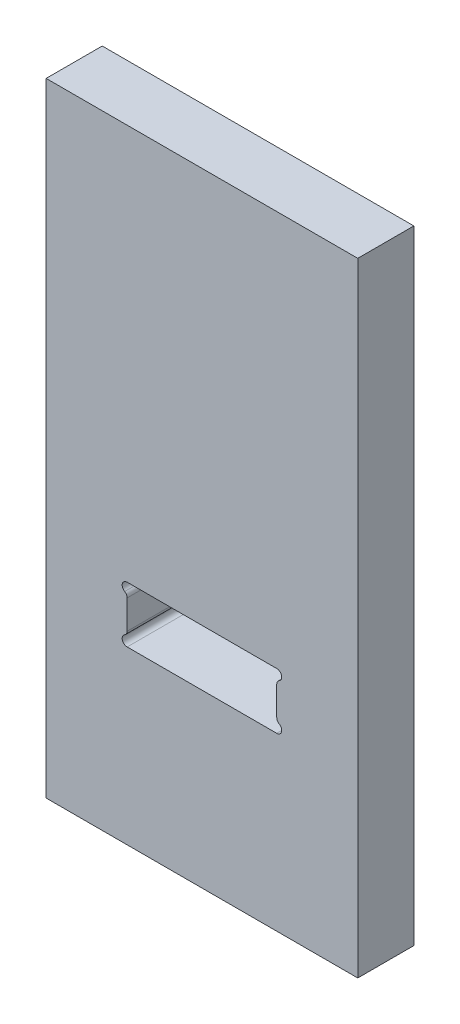
ISO-10303-21;
HEADER;
FILE_DESCRIPTION(('STEP AP214'),'2;1');
FILE_NAME('part.step','',(''),(''),'','','');
FILE_SCHEMA(('AUTOMOTIVE_DESIGN { 1 0 10303 214 1 1 1 1 }'));
ENDSEC;
DATA;
#1=APPLICATION_CONTEXT('core data for automotive mechanical design processes');
#2=APPLICATION_PROTOCOL_DEFINITION('international standard','automotive_design',2000,#1);
#3=PRODUCT_CONTEXT('',#1,'mechanical');
#4=PRODUCT('Part','Part','',(#3));
#5=PRODUCT_RELATED_PRODUCT_CATEGORY('part','',(#4));
#6=PRODUCT_DEFINITION_FORMATION('','',#4);
#7=PRODUCT_DEFINITION_CONTEXT('part definition',#1,'design');
#8=PRODUCT_DEFINITION('design','',#6,#7);
#9=PRODUCT_DEFINITION_SHAPE('','',#8);
#10=(LENGTH_UNIT() NAMED_UNIT(*) SI_UNIT(.MILLI.,.METRE.));
#11=(NAMED_UNIT(*) PLANE_ANGLE_UNIT() SI_UNIT($,.RADIAN.));
#12=(NAMED_UNIT(*) SI_UNIT($,.STERADIAN.) SOLID_ANGLE_UNIT());
#13=UNCERTAINTY_MEASURE_WITH_UNIT(LENGTH_MEASURE(1.E-05),#10,'distance_accuracy_value','');
#14=(GEOMETRIC_REPRESENTATION_CONTEXT(3) GLOBAL_UNCERTAINTY_ASSIGNED_CONTEXT((#13)) GLOBAL_UNIT_ASSIGNED_CONTEXT((#10,
#11,#12)) REPRESENTATION_CONTEXT('',''));
#15=CARTESIAN_POINT('',(0.,0.,0.));
#16=DIRECTION('',(0.,0.,1.));
#17=DIRECTION('',(1.,0.,0.));
#18=AXIS2_PLACEMENT_3D('',#15,#16,#17);
#19=CARTESIAN_POINT('',(0.,0.,4.5));
#20=DIRECTION('',(1.,0.,0.));
#21=DIRECTION('',(0.,0.,-1.));
#22=AXIS2_PLACEMENT_3D('',#19,#20,#21);
#23=PLANE('',#22);
#24=DIRECTION('',(0.,-1.,0.));
#25=VECTOR('',#24,1.);
#26=CARTESIAN_POINT('',(0.,0.,0.));
#27=LINE('',#26,#25);
#28=CARTESIAN_POINT('',(0.,50.,0.));
#29=VERTEX_POINT('',#28);
#30=CARTESIAN_POINT('',(0.,0.,0.));
#31=VERTEX_POINT('',#30);
#32=EDGE_CURVE('E151',#29,#31,#27,.T.);
#33=ORIENTED_EDGE('',*,*,#32,.T.);
#34=DIRECTION('',(0.,0.,-1.));
#35=VECTOR('',#34,1.);
#36=CARTESIAN_POINT('',(0.,0.,4.5));
#37=LINE('',#36,#35);
#38=CARTESIAN_POINT('',(0.,0.,4.5));
#39=VERTEX_POINT('',#38);
#40=EDGE_CURVE('E11',#39,#31,#37,.T.);
#41=ORIENTED_EDGE('',*,*,#40,.F.);
#42=DIRECTION('',(0.,-1.,0.));
#43=VECTOR('',#42,1.);
#44=CARTESIAN_POINT('',(0.,0.,4.5));
#45=LINE('',#44,#43);
#46=CARTESIAN_POINT('',(0.,50.,4.5));
#47=VERTEX_POINT('',#46);
#48=EDGE_CURVE('E221',#47,#39,#45,.T.);
#49=ORIENTED_EDGE('',*,*,#48,.F.);
#50=DIRECTION('',(0.,0.,-1.));
#51=VECTOR('',#50,1.);
#52=CARTESIAN_POINT('',(0.,50.,4.5));
#53=LINE('',#52,#51);
#54=EDGE_CURVE('E231',#47,#29,#53,.T.);
#55=ORIENTED_EDGE('',*,*,#54,.T.);
#56=EDGE_LOOP('',(#33,#41,#49,#55));
#57=FACE_BOUND('',#56,.T.);
#58=ADVANCED_FACE('F33',(#57),#23,.F.);
#59=CARTESIAN_POINT('',(0.,0.,4.5));
#60=DIRECTION('',(0.,1.,0.));
#61=DIRECTION('',(0.,0.,1.));
#62=AXIS2_PLACEMENT_3D('',#59,#60,#61);
#63=PLANE('',#62);
#64=DIRECTION('',(1.,0.,0.));
#65=VECTOR('',#64,1.);
#66=CARTESIAN_POINT('',(0.,0.,0.));
#67=LINE('',#66,#65);
#68=CARTESIAN_POINT('',(25.,0.,0.));
#69=VERTEX_POINT('',#68);
#70=EDGE_CURVE('E234',#31,#69,#67,.T.);
#71=ORIENTED_EDGE('',*,*,#70,.T.);
#72=DIRECTION('',(0.,0.,-1.));
#73=VECTOR('',#72,1.);
#74=CARTESIAN_POINT('',(25.,0.,4.5));
#75=LINE('',#74,#73);
#76=CARTESIAN_POINT('',(25.,0.,4.5));
#77=VERTEX_POINT('',#76);
#78=EDGE_CURVE('E40',#77,#69,#75,.T.);
#79=ORIENTED_EDGE('',*,*,#78,.F.);
#80=DIRECTION('',(1.,0.,0.));
#81=VECTOR('',#80,1.);
#82=CARTESIAN_POINT('',(0.,0.,4.5));
#83=LINE('',#82,#81);
#84=EDGE_CURVE('E224',#39,#77,#83,.T.);
#85=ORIENTED_EDGE('',*,*,#84,.F.);
#86=ORIENTED_EDGE('',*,*,#40,.T.);
#87=EDGE_LOOP('',(#71,#79,#85,#86));
#88=FACE_BOUND('',#87,.T.);
#89=ADVANCED_FACE('F262',(#88),#63,.F.);
#90=CARTESIAN_POINT('',(25.,0.,4.5));
#91=DIRECTION('',(-1.,0.,0.));
#92=DIRECTION('',(0.,-1.,0.));
#93=AXIS2_PLACEMENT_3D('',#90,#91,#92);
#94=PLANE('',#93);
#95=DIRECTION('',(0.,1.,0.));
#96=VECTOR('',#95,1.);
#97=CARTESIAN_POINT('',(25.,0.,0.));
#98=LINE('',#97,#96);
#99=CARTESIAN_POINT('',(25.,50.,0.));
#100=VERTEX_POINT('',#99);
#101=EDGE_CURVE('E236',#69,#100,#98,.T.);
#102=ORIENTED_EDGE('',*,*,#101,.T.);
#103=DIRECTION('',(0.,0.,-1.));
#104=VECTOR('',#103,1.);
#105=CARTESIAN_POINT('',(25.,50.,4.5));
#106=LINE('',#105,#104);
#107=CARTESIAN_POINT('',(25.,50.,4.5));
#108=VERTEX_POINT('',#107);
#109=EDGE_CURVE('E241',#108,#100,#106,.T.);
#110=ORIENTED_EDGE('',*,*,#109,.F.);
#111=DIRECTION('',(0.,1.,0.));
#112=VECTOR('',#111,1.);
#113=CARTESIAN_POINT('',(25.,0.,4.5));
#114=LINE('',#113,#112);
#115=EDGE_CURVE('E227',#77,#108,#114,.T.);
#116=ORIENTED_EDGE('',*,*,#115,.F.);
#117=ORIENTED_EDGE('',*,*,#78,.T.);
#118=EDGE_LOOP('',(#102,#110,#116,#117));
#119=FACE_BOUND('',#118,.T.);
#120=ADVANCED_FACE('F248',(#119),#94,.F.);
#121=CARTESIAN_POINT('',(0.,50.,4.5));
#122=DIRECTION('',(0.,-1.,0.));
#123=DIRECTION('',(0.,0.,-1.));
#124=AXIS2_PLACEMENT_3D('',#121,#122,#123);
#125=PLANE('',#124);
#126=DIRECTION('',(-1.,0.,0.));
#127=VECTOR('',#126,1.);
#128=CARTESIAN_POINT('',(0.,50.,0.));
#129=LINE('',#128,#127);
#130=EDGE_CURVE('E225',#100,#29,#129,.T.);
#131=ORIENTED_EDGE('',*,*,#130,.T.);
#132=ORIENTED_EDGE('',*,*,#54,.F.);
#133=DIRECTION('',(-1.,0.,0.));
#134=VECTOR('',#133,1.);
#135=CARTESIAN_POINT('',(0.,50.,4.5));
#136=LINE('',#135,#134);
#137=EDGE_CURVE('E229',#108,#47,#136,.T.);
#138=ORIENTED_EDGE('',*,*,#137,.F.);
#139=ORIENTED_EDGE('',*,*,#109,.T.);
#140=EDGE_LOOP('',(#131,#132,#138,#139));
#141=FACE_BOUND('',#140,.T.);
#142=ADVANCED_FACE('F255',(#141),#125,.F.);
#143=CARTESIAN_POINT('',(0.,0.,4.5));
#144=DIRECTION('',(0.,0.,-1.));
#145=DIRECTION('',(-1.,0.,0.));
#146=AXIS2_PLACEMENT_3D('',#143,#144,#145);
#147=PLANE('',#146);
#148=DIRECTION('',(-1.,0.,0.));
#149=VECTOR('',#148,1.);
#150=CARTESIAN_POINT('',(6.5,18.25,4.5));
#151=LINE('',#150,#149);
#152=CARTESIAN_POINT('',(18.5,18.25,4.5));
#153=VERTEX_POINT('',#152);
#154=CARTESIAN_POINT('',(6.5,18.25,4.5));
#155=VERTEX_POINT('',#154);
#156=EDGE_CURVE('E165',#153,#155,#151,.T.);
#157=ORIENTED_EDGE('',*,*,#156,.F.);
#158=CARTESIAN_POINT('',(18.5,17.85,4.5));
#159=DIRECTION('',(0.,0.,1.));
#160=DIRECTION('',(-1.,0.,0.));
#161=AXIS2_PLACEMENT_3D('',#158,#159,#160);
#162=CIRCLE('',#161,0.400000000000001);
#163=CARTESIAN_POINT('',(18.7,17.5035898384862,4.5));
#164=VERTEX_POINT('',#163);
#165=EDGE_CURVE('E47',#164,#153,#162,.T.);
#166=ORIENTED_EDGE('',*,*,#165,.F.);
#167=CARTESIAN_POINT('',(18.9,17.1571796769724,4.5));
#168=DIRECTION('',(0.,0.,-1.));
#169=DIRECTION('',(1.,0.,0.));
#170=AXIS2_PLACEMENT_3D('',#167,#168,#169);
#171=CIRCLE('',#170,0.399999999999999);
#172=CARTESIAN_POINT('',(18.5,17.1571796769724,4.5));
#173=VERTEX_POINT('',#172);
#174=EDGE_CURVE('E157',#173,#164,#171,.T.);
#175=ORIENTED_EDGE('',*,*,#174,.F.);
#176=DIRECTION('',(0.,1.,0.));
#177=VECTOR('',#176,1.);
#178=CARTESIAN_POINT('',(18.5,17.1571796769724,4.5));
#179=LINE('',#178,#177);
#180=CARTESIAN_POINT('',(18.5,14.8428203230276,4.5));
#181=VERTEX_POINT('',#180);
#182=EDGE_CURVE('E196',#181,#173,#179,.T.);
#183=ORIENTED_EDGE('',*,*,#182,.F.);
#184=CARTESIAN_POINT('',(18.9,14.8428203230276,4.5));
#185=DIRECTION('',(0.,0.,-1.));
#186=DIRECTION('',(-1.,0.,0.));
#187=AXIS2_PLACEMENT_3D('',#184,#185,#186);
#188=CIRCLE('',#187,0.399999999999999);
#189=CARTESIAN_POINT('',(18.7,14.4964101615138,4.5));
#190=VERTEX_POINT('',#189);
#191=EDGE_CURVE('E193',#190,#181,#188,.T.);
#192=ORIENTED_EDGE('',*,*,#191,.F.);
#193=CARTESIAN_POINT('',(18.5,14.15,4.5));
#194=DIRECTION('',(0.,0.,1.));
#195=DIRECTION('',(1.,0.,0.));
#196=AXIS2_PLACEMENT_3D('',#193,#194,#195);
#197=CIRCLE('',#196,0.400000000000001);
#198=CARTESIAN_POINT('',(18.5,13.75,4.5));
#199=VERTEX_POINT('',#198);
#200=EDGE_CURVE('E190',#199,#190,#197,.T.);
#201=ORIENTED_EDGE('',*,*,#200,.F.);
#202=DIRECTION('',(1.,0.,0.));
#203=VECTOR('',#202,1.);
#204=CARTESIAN_POINT('',(6.5,13.75,4.5));
#205=LINE('',#204,#203);
#206=CARTESIAN_POINT('',(6.5,13.75,4.5));
#207=VERTEX_POINT('',#206);
#208=EDGE_CURVE('E187',#207,#199,#205,.T.);
#209=ORIENTED_EDGE('',*,*,#208,.F.);
#210=CARTESIAN_POINT('',(6.5,14.15,4.5));
#211=DIRECTION('',(0.,0.,1.));
#212=DIRECTION('',(-1.,0.,0.));
#213=AXIS2_PLACEMENT_3D('',#210,#211,#212);
#214=CIRCLE('',#213,0.400000000000001);
#215=CARTESIAN_POINT('',(6.3,14.4964101615138,4.5));
#216=VERTEX_POINT('',#215);
#217=EDGE_CURVE('E184',#216,#207,#214,.T.);
#218=ORIENTED_EDGE('',*,*,#217,.F.);
#219=CARTESIAN_POINT('',(6.1,14.8428203230276,4.5));
#220=DIRECTION('',(0.,0.,-1.));
#221=DIRECTION('',(1.,0.,0.));
#222=AXIS2_PLACEMENT_3D('',#219,#220,#221);
#223=CIRCLE('',#222,0.399999999999999);
#224=CARTESIAN_POINT('',(6.5,14.8428203230276,4.5));
#225=VERTEX_POINT('',#224);
#226=EDGE_CURVE('E181',#225,#216,#223,.T.);
#227=ORIENTED_EDGE('',*,*,#226,.F.);
#228=DIRECTION('',(0.,-1.,0.));
#229=VECTOR('',#228,1.);
#230=CARTESIAN_POINT('',(6.5,17.1571796769724,4.5));
#231=LINE('',#230,#229);
#232=CARTESIAN_POINT('',(6.5,17.1571796769724,4.5));
#233=VERTEX_POINT('',#232);
#234=EDGE_CURVE('E178',#233,#225,#231,.T.);
#235=ORIENTED_EDGE('',*,*,#234,.F.);
#236=CARTESIAN_POINT('',(6.1,17.1571796769724,4.5));
#237=DIRECTION('',(0.,0.,-1.));
#238=DIRECTION('',(-1.,0.,0.));
#239=AXIS2_PLACEMENT_3D('',#236,#237,#238);
#240=CIRCLE('',#239,0.399999999999999);
#241=CARTESIAN_POINT('',(6.3,17.5035898384862,4.5));
#242=VERTEX_POINT('',#241);
#243=EDGE_CURVE('E175',#242,#233,#240,.T.);
#244=ORIENTED_EDGE('',*,*,#243,.F.);
#245=CARTESIAN_POINT('',(6.5,17.85,4.5));
#246=DIRECTION('',(0.,0.,1.));
#247=DIRECTION('',(1.,0.,0.));
#248=AXIS2_PLACEMENT_3D('',#245,#246,#247);
#249=CIRCLE('',#248,0.4);
#250=EDGE_CURVE('E172',#155,#242,#249,.T.);
#251=ORIENTED_EDGE('',*,*,#250,.F.);
#252=EDGE_LOOP('',(#157,#166,#175,#183,#192,#201,#209,#218,#227,#235,#244,#251));
#253=FACE_BOUND('',#252,.T.);
#254=ORIENTED_EDGE('',*,*,#48,.T.);
#255=ORIENTED_EDGE('',*,*,#84,.T.);
#256=ORIENTED_EDGE('',*,*,#115,.T.);
#257=ORIENTED_EDGE('',*,*,#137,.T.);
#258=EDGE_LOOP('',(#254,#255,#256,#257));
#259=FACE_BOUND('',#258,.T.);
#260=ADVANCED_FACE('F261',(#253,#259),#147,.F.);
#261=CARTESIAN_POINT('',(0.,0.,0.));
#262=DIRECTION('',(0.,0.,-1.));
#263=DIRECTION('',(-1.,0.,0.));
#264=AXIS2_PLACEMENT_3D('',#261,#262,#263);
#265=PLANE('',#264);
#266=CARTESIAN_POINT('',(18.5,17.85,0.));
#267=DIRECTION('',(0.,0.,-1.));
#268=DIRECTION('',(-1.,0.,0.));
#269=AXIS2_PLACEMENT_3D('',#266,#267,#268);
#270=CIRCLE('',#269,0.400000000000001);
#271=CARTESIAN_POINT('',(18.7,17.5035898384862,0.));
#272=VERTEX_POINT('',#271);
#273=CARTESIAN_POINT('',(18.5,18.25,0.));
#274=VERTEX_POINT('',#273);
#275=EDGE_CURVE('E155',#272,#274,#270,.F.);
#276=ORIENTED_EDGE('',*,*,#275,.T.);
#277=DIRECTION('',(-1.,0.,0.));
#278=VECTOR('',#277,1.);
#279=CARTESIAN_POINT('',(6.5,18.25,0.));
#280=LINE('',#279,#278);
#281=CARTESIAN_POINT('',(6.5,18.25,0.));
#282=VERTEX_POINT('',#281);
#283=EDGE_CURVE('E144',#274,#282,#280,.T.);
#284=ORIENTED_EDGE('',*,*,#283,.T.);
#285=CARTESIAN_POINT('',(6.5,17.85,0.));
#286=DIRECTION('',(0.,0.,-1.));
#287=DIRECTION('',(-1.,0.,0.));
#288=AXIS2_PLACEMENT_3D('',#285,#286,#287);
#289=CIRCLE('',#288,0.4);
#290=CARTESIAN_POINT('',(6.3,17.5035898384862,0.));
#291=VERTEX_POINT('',#290);
#292=EDGE_CURVE('E331',#282,#291,#289,.F.);
#293=ORIENTED_EDGE('',*,*,#292,.T.);
#294=CARTESIAN_POINT('',(6.1,17.1571796769724,0.));
#295=DIRECTION('',(0.,0.,-1.));
#296=DIRECTION('',(-1.,0.,0.));
#297=AXIS2_PLACEMENT_3D('',#294,#295,#296);
#298=CIRCLE('',#297,0.399999999999999);
#299=CARTESIAN_POINT('',(6.5,17.1571796769724,0.));
#300=VERTEX_POINT('',#299);
#301=EDGE_CURVE('E333',#291,#300,#298,.T.);
#302=ORIENTED_EDGE('',*,*,#301,.T.);
#303=DIRECTION('',(0.,-1.,0.));
#304=VECTOR('',#303,1.);
#305=CARTESIAN_POINT('',(6.5,17.1571796769724,0.));
#306=LINE('',#305,#304);
#307=CARTESIAN_POINT('',(6.5,14.8428203230276,0.));
#308=VERTEX_POINT('',#307);
#309=EDGE_CURVE('E335',#300,#308,#306,.T.);
#310=ORIENTED_EDGE('',*,*,#309,.T.);
#311=CARTESIAN_POINT('',(6.1,14.8428203230276,0.));
#312=DIRECTION('',(0.,0.,-1.));
#313=DIRECTION('',(-1.,0.,0.));
#314=AXIS2_PLACEMENT_3D('',#311,#312,#313);
#315=CIRCLE('',#314,0.399999999999999);
#316=CARTESIAN_POINT('',(6.3,14.4964101615138,0.));
#317=VERTEX_POINT('',#316);
#318=EDGE_CURVE('E340',#308,#317,#315,.T.);
#319=ORIENTED_EDGE('',*,*,#318,.T.);
#320=CARTESIAN_POINT('',(6.5,14.15,0.));
#321=DIRECTION('',(0.,0.,-1.));
#322=DIRECTION('',(-1.,0.,0.));
#323=AXIS2_PLACEMENT_3D('',#320,#321,#322);
#324=CIRCLE('',#323,0.400000000000001);
#325=CARTESIAN_POINT('',(6.5,13.75,0.));
#326=VERTEX_POINT('',#325);
#327=EDGE_CURVE('E343',#317,#326,#324,.F.);
#328=ORIENTED_EDGE('',*,*,#327,.T.);
#329=DIRECTION('',(1.,0.,0.));
#330=VECTOR('',#329,1.);
#331=CARTESIAN_POINT('',(6.5,13.75,0.));
#332=LINE('',#331,#330);
#333=CARTESIAN_POINT('',(18.5,13.75,0.));
#334=VERTEX_POINT('',#333);
#335=EDGE_CURVE('E346',#326,#334,#332,.T.);
#336=ORIENTED_EDGE('',*,*,#335,.T.);
#337=CARTESIAN_POINT('',(18.5,14.15,0.));
#338=DIRECTION('',(0.,0.,-1.));
#339=DIRECTION('',(-1.,0.,0.));
#340=AXIS2_PLACEMENT_3D('',#337,#338,#339);
#341=CIRCLE('',#340,0.400000000000001);
#342=CARTESIAN_POINT('',(18.7,14.4964101615138,0.));
#343=VERTEX_POINT('',#342);
#344=EDGE_CURVE('E349',#334,#343,#341,.F.);
#345=ORIENTED_EDGE('',*,*,#344,.T.);
#346=CARTESIAN_POINT('',(18.9,14.8428203230276,0.));
#347=DIRECTION('',(0.,0.,-1.));
#348=DIRECTION('',(-1.,0.,0.));
#349=AXIS2_PLACEMENT_3D('',#346,#347,#348);
#350=CIRCLE('',#349,0.399999999999999);
#351=CARTESIAN_POINT('',(18.5,14.8428203230276,0.));
#352=VERTEX_POINT('',#351);
#353=EDGE_CURVE('E352',#343,#352,#350,.T.);
#354=ORIENTED_EDGE('',*,*,#353,.T.);
#355=DIRECTION('',(0.,1.,0.));
#356=VECTOR('',#355,1.);
#357=CARTESIAN_POINT('',(18.5,17.1571796769724,0.));
#358=LINE('',#357,#356);
#359=CARTESIAN_POINT('',(18.5,17.1571796769724,0.));
#360=VERTEX_POINT('',#359);
#361=EDGE_CURVE('E167',#352,#360,#358,.T.);
#362=ORIENTED_EDGE('',*,*,#361,.T.);
#363=CARTESIAN_POINT('',(18.9,17.1571796769724,0.));
#364=DIRECTION('',(0.,0.,-1.));
#365=DIRECTION('',(-1.,0.,0.));
#366=AXIS2_PLACEMENT_3D('',#363,#364,#365);
#367=CIRCLE('',#366,0.399999999999999);
#368=EDGE_CURVE('E163',#360,#272,#367,.T.);
#369=ORIENTED_EDGE('',*,*,#368,.T.);
#370=EDGE_LOOP('',(#276,#284,#293,#302,#310,#319,#328,#336,#345,#354,#362,#369));
#371=FACE_BOUND('',#370,.T.);
#372=ORIENTED_EDGE('',*,*,#32,.F.);
#373=ORIENTED_EDGE('',*,*,#130,.F.);
#374=ORIENTED_EDGE('',*,*,#101,.F.);
#375=ORIENTED_EDGE('',*,*,#70,.F.);
#376=EDGE_LOOP('',(#372,#373,#374,#375));
#377=FACE_BOUND('',#376,.T.);
#378=ADVANCED_FACE('F160',(#371,#377),#265,.T.);
#379=CARTESIAN_POINT('',(18.5,17.85,-0.00100000000000013));
#380=DIRECTION('',(0.,0.,1.));
#381=DIRECTION('',(1.,0.,0.));
#382=AXIS2_PLACEMENT_3D('',#379,#380,#381);
#383=CYLINDRICAL_SURFACE('',#382,0.400000000000001);
#384=DIRECTION('',(0.,0.,1.));
#385=VECTOR('',#384,1.);
#386=CARTESIAN_POINT('',(18.7,17.5035898384862,-0.00100000000000013));
#387=LINE('',#386,#385);
#388=EDGE_CURVE('E152',#272,#164,#387,.T.);
#389=ORIENTED_EDGE('',*,*,#388,.T.);
#390=ORIENTED_EDGE('',*,*,#165,.T.);
#391=DIRECTION('',(0.,0.,1.));
#392=VECTOR('',#391,1.);
#393=CARTESIAN_POINT('',(18.5,18.25,-0.00100000000000013));
#394=LINE('',#393,#392);
#395=EDGE_CURVE('E146',#274,#153,#394,.T.);
#396=ORIENTED_EDGE('',*,*,#395,.F.);
#397=ORIENTED_EDGE('',*,*,#275,.F.);
#398=EDGE_LOOP('',(#389,#390,#396,#397));
#399=FACE_BOUND('',#398,.T.);
#400=ADVANCED_FACE('F154',(#399),#383,.F.);
#401=CARTESIAN_POINT('',(18.9,17.1571796769724,-0.00100000000000013));
#402=DIRECTION('',(0.,0.,1.));
#403=DIRECTION('',(1.,0.,0.));
#404=AXIS2_PLACEMENT_3D('',#401,#402,#403);
#405=CYLINDRICAL_SURFACE('',#404,0.399999999999999);
#406=DIRECTION('',(0.,0.,1.));
#407=VECTOR('',#406,1.);
#408=CARTESIAN_POINT('',(18.5,17.1571796769724,-0.00100000000000013));
#409=LINE('',#408,#407);
#410=EDGE_CURVE('E202',#360,#173,#409,.T.);
#411=ORIENTED_EDGE('',*,*,#410,.T.);
#412=ORIENTED_EDGE('',*,*,#174,.T.);
#413=ORIENTED_EDGE('',*,*,#388,.F.);
#414=ORIENTED_EDGE('',*,*,#368,.F.);
#415=EDGE_LOOP('',(#411,#412,#413,#414));
#416=FACE_BOUND('',#415,.T.);
#417=ADVANCED_FACE('F279',(#416),#405,.T.);
#418=CARTESIAN_POINT('',(18.5,17.1571796769724,-0.00100000000000013));
#419=DIRECTION('',(1.,0.,0.));
#420=DIRECTION('',(0.,0.,-1.));
#421=AXIS2_PLACEMENT_3D('',#418,#419,#420);
#422=PLANE('',#421);
#423=DIRECTION('',(0.,0.,1.));
#424=VECTOR('',#423,1.);
#425=CARTESIAN_POINT('',(18.5,14.8428203230276,-0.00100000000000013));
#426=LINE('',#425,#424);
#427=EDGE_CURVE('E204',#352,#181,#426,.T.);
#428=ORIENTED_EDGE('',*,*,#427,.T.);
#429=ORIENTED_EDGE('',*,*,#182,.T.);
#430=ORIENTED_EDGE('',*,*,#410,.F.);
#431=ORIENTED_EDGE('',*,*,#361,.F.);
#432=EDGE_LOOP('',(#428,#429,#430,#431));
#433=FACE_BOUND('',#432,.T.);
#434=ADVANCED_FACE('F313',(#433),#422,.F.);
#435=CARTESIAN_POINT('',(18.9,14.8428203230276,-0.00100000000000013));
#436=DIRECTION('',(0.,0.,1.));
#437=DIRECTION('',(1.,0.,0.));
#438=AXIS2_PLACEMENT_3D('',#435,#436,#437);
#439=CYLINDRICAL_SURFACE('',#438,0.399999999999999);
#440=DIRECTION('',(0.,0.,1.));
#441=VECTOR('',#440,1.);
#442=CARTESIAN_POINT('',(18.7,14.4964101615138,-0.00100000000000013));
#443=LINE('',#442,#441);
#444=EDGE_CURVE('E206',#343,#190,#443,.T.);
#445=ORIENTED_EDGE('',*,*,#444,.T.);
#446=ORIENTED_EDGE('',*,*,#191,.T.);
#447=ORIENTED_EDGE('',*,*,#427,.F.);
#448=ORIENTED_EDGE('',*,*,#353,.F.);
#449=EDGE_LOOP('',(#445,#446,#447,#448));
#450=FACE_BOUND('',#449,.T.);
#451=ADVANCED_FACE('F309',(#450),#439,.T.);
#452=CARTESIAN_POINT('',(18.5,14.15,-0.00100000000000013));
#453=DIRECTION('',(0.,0.,1.));
#454=DIRECTION('',(1.,0.,0.));
#455=AXIS2_PLACEMENT_3D('',#452,#453,#454);
#456=CYLINDRICAL_SURFACE('',#455,0.400000000000001);
#457=DIRECTION('',(0.,0.,1.));
#458=VECTOR('',#457,1.);
#459=CARTESIAN_POINT('',(18.5,13.75,-0.00100000000000013));
#460=LINE('',#459,#458);
#461=EDGE_CURVE('E208',#334,#199,#460,.T.);
#462=ORIENTED_EDGE('',*,*,#461,.T.);
#463=ORIENTED_EDGE('',*,*,#200,.T.);
#464=ORIENTED_EDGE('',*,*,#444,.F.);
#465=ORIENTED_EDGE('',*,*,#344,.F.);
#466=EDGE_LOOP('',(#462,#463,#464,#465));
#467=FACE_BOUND('',#466,.T.);
#468=ADVANCED_FACE('F305',(#467),#456,.F.);
#469=CARTESIAN_POINT('',(6.5,13.75,-0.00100000000000013));
#470=DIRECTION('',(0.,-1.,0.));
#471=DIRECTION('',(1.,0.,0.));
#472=AXIS2_PLACEMENT_3D('',#469,#470,#471);
#473=PLANE('',#472);
#474=DIRECTION('',(0.,0.,1.));
#475=VECTOR('',#474,1.);
#476=CARTESIAN_POINT('',(6.5,13.75,-0.00100000000000013));
#477=LINE('',#476,#475);
#478=EDGE_CURVE('E210',#326,#207,#477,.T.);
#479=ORIENTED_EDGE('',*,*,#478,.T.);
#480=ORIENTED_EDGE('',*,*,#208,.T.);
#481=ORIENTED_EDGE('',*,*,#461,.F.);
#482=ORIENTED_EDGE('',*,*,#335,.F.);
#483=EDGE_LOOP('',(#479,#480,#481,#482));
#484=FACE_BOUND('',#483,.T.);
#485=ADVANCED_FACE('F301',(#484),#473,.F.);
#486=CARTESIAN_POINT('',(6.5,14.15,-0.00100000000000013));
#487=DIRECTION('',(0.,0.,1.));
#488=DIRECTION('',(1.,0.,0.));
#489=AXIS2_PLACEMENT_3D('',#486,#487,#488);
#490=CYLINDRICAL_SURFACE('',#489,0.400000000000001);
#491=DIRECTION('',(0.,0.,1.));
#492=VECTOR('',#491,1.);
#493=CARTESIAN_POINT('',(6.3,14.4964101615138,-0.00100000000000013));
#494=LINE('',#493,#492);
#495=EDGE_CURVE('E212',#317,#216,#494,.T.);
#496=ORIENTED_EDGE('',*,*,#495,.T.);
#497=ORIENTED_EDGE('',*,*,#217,.T.);
#498=ORIENTED_EDGE('',*,*,#478,.F.);
#499=ORIENTED_EDGE('',*,*,#327,.F.);
#500=EDGE_LOOP('',(#496,#497,#498,#499));
#501=FACE_BOUND('',#500,.T.);
#502=ADVANCED_FACE('F297',(#501),#490,.F.);
#503=CARTESIAN_POINT('',(6.1,14.8428203230276,-0.00100000000000013));
#504=DIRECTION('',(0.,0.,1.));
#505=DIRECTION('',(1.,0.,0.));
#506=AXIS2_PLACEMENT_3D('',#503,#504,#505);
#507=CYLINDRICAL_SURFACE('',#506,0.399999999999999);
#508=DIRECTION('',(0.,0.,1.));
#509=VECTOR('',#508,1.);
#510=CARTESIAN_POINT('',(6.5,14.8428203230276,-0.00100000000000013));
#511=LINE('',#510,#509);
#512=EDGE_CURVE('E214',#308,#225,#511,.T.);
#513=ORIENTED_EDGE('',*,*,#512,.T.);
#514=ORIENTED_EDGE('',*,*,#226,.T.);
#515=ORIENTED_EDGE('',*,*,#495,.F.);
#516=ORIENTED_EDGE('',*,*,#318,.F.);
#517=EDGE_LOOP('',(#513,#514,#515,#516));
#518=FACE_BOUND('',#517,.T.);
#519=ADVANCED_FACE('F293',(#518),#507,.T.);
#520=CARTESIAN_POINT('',(6.5,17.1571796769724,-0.00100000000000013));
#521=DIRECTION('',(-1.,0.,0.));
#522=DIRECTION('',(0.,0.,1.));
#523=AXIS2_PLACEMENT_3D('',#520,#521,#522);
#524=PLANE('',#523);
#525=DIRECTION('',(0.,0.,1.));
#526=VECTOR('',#525,1.);
#527=CARTESIAN_POINT('',(6.5,17.1571796769724,-0.00100000000000013));
#528=LINE('',#527,#526);
#529=EDGE_CURVE('E216',#300,#233,#528,.T.);
#530=ORIENTED_EDGE('',*,*,#529,.T.);
#531=ORIENTED_EDGE('',*,*,#234,.T.);
#532=ORIENTED_EDGE('',*,*,#512,.F.);
#533=ORIENTED_EDGE('',*,*,#309,.F.);
#534=EDGE_LOOP('',(#530,#531,#532,#533));
#535=FACE_BOUND('',#534,.T.);
#536=ADVANCED_FACE('F289',(#535),#524,.F.);
#537=CARTESIAN_POINT('',(6.1,17.1571796769724,-0.00100000000000013));
#538=DIRECTION('',(0.,0.,1.));
#539=DIRECTION('',(1.,0.,0.));
#540=AXIS2_PLACEMENT_3D('',#537,#538,#539);
#541=CYLINDRICAL_SURFACE('',#540,0.399999999999999);
#542=DIRECTION('',(0.,0.,1.));
#543=VECTOR('',#542,1.);
#544=CARTESIAN_POINT('',(6.3,17.5035898384862,-0.00100000000000013));
#545=LINE('',#544,#543);
#546=EDGE_CURVE('E218',#291,#242,#545,.T.);
#547=ORIENTED_EDGE('',*,*,#546,.T.);
#548=ORIENTED_EDGE('',*,*,#243,.T.);
#549=ORIENTED_EDGE('',*,*,#529,.F.);
#550=ORIENTED_EDGE('',*,*,#301,.F.);
#551=EDGE_LOOP('',(#547,#548,#549,#550));
#552=FACE_BOUND('',#551,.T.);
#553=ADVANCED_FACE('F285',(#552),#541,.T.);
#554=CARTESIAN_POINT('',(6.5,17.85,-0.00100000000000013));
#555=DIRECTION('',(0.,0.,1.));
#556=DIRECTION('',(1.,0.,0.));
#557=AXIS2_PLACEMENT_3D('',#554,#555,#556);
#558=CYLINDRICAL_SURFACE('',#557,0.4);
#559=DIRECTION('',(0.,0.,1.));
#560=VECTOR('',#559,1.);
#561=CARTESIAN_POINT('',(6.5,18.25,-0.00100000000000013));
#562=LINE('',#561,#560);
#563=EDGE_CURVE('E55',#282,#155,#562,.T.);
#564=ORIENTED_EDGE('',*,*,#563,.T.);
#565=ORIENTED_EDGE('',*,*,#250,.T.);
#566=ORIENTED_EDGE('',*,*,#546,.F.);
#567=ORIENTED_EDGE('',*,*,#292,.F.);
#568=EDGE_LOOP('',(#564,#565,#566,#567));
#569=FACE_BOUND('',#568,.T.);
#570=ADVANCED_FACE('F282',(#569),#558,.F.);
#571=CARTESIAN_POINT('',(6.5,18.25,-0.00100000000000013));
#572=DIRECTION('',(0.,1.,0.));
#573=DIRECTION('',(0.,0.,1.));
#574=AXIS2_PLACEMENT_3D('',#571,#572,#573);
#575=PLANE('',#574);
#576=ORIENTED_EDGE('',*,*,#395,.T.);
#577=ORIENTED_EDGE('',*,*,#156,.T.);
#578=ORIENTED_EDGE('',*,*,#563,.F.);
#579=ORIENTED_EDGE('',*,*,#283,.F.);
#580=EDGE_LOOP('',(#576,#577,#578,#579));
#581=FACE_BOUND('',#580,.T.);
#582=ADVANCED_FACE('F145',(#581),#575,.F.);
#583=CLOSED_SHELL('',(#58,#89,#120,#142,#260,#378,#400,#417,#434,#451,#468,#485,#502,#519,#536,
#553,#570,#582));
#584=MANIFOLD_SOLID_BREP('B2',#583);
#585=ADVANCED_BREP_SHAPE_REPRESENTATION('',(#18,#584),#14);
#586=SHAPE_DEFINITION_REPRESENTATION(#9,#585);
ENDSEC;
END-ISO-10303-21;
